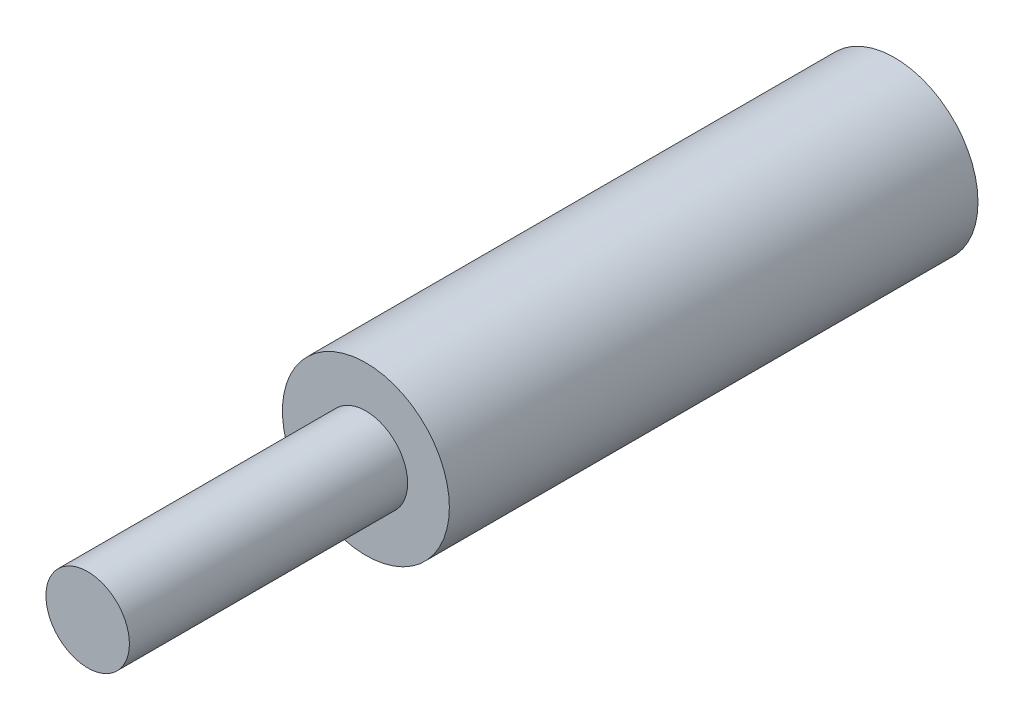
ISO-10303-21;
HEADER;
FILE_DESCRIPTION(('STEP AP214'),'2;1');
FILE_NAME('part.step','',(''),(''),'','','');
FILE_SCHEMA(('AUTOMOTIVE_DESIGN { 1 0 10303 214 1 1 1 1 }'));
ENDSEC;
DATA;
#1=APPLICATION_CONTEXT('core data for automotive mechanical design processes');
#2=APPLICATION_PROTOCOL_DEFINITION('international standard','automotive_design',2000,#1);
#3=PRODUCT_CONTEXT('',#1,'mechanical');
#4=PRODUCT('Part','Part','',(#3));
#5=PRODUCT_RELATED_PRODUCT_CATEGORY('part','',(#4));
#6=PRODUCT_DEFINITION_FORMATION('','',#4);
#7=PRODUCT_DEFINITION_CONTEXT('part definition',#1,'design');
#8=PRODUCT_DEFINITION('design','',#6,#7);
#9=PRODUCT_DEFINITION_SHAPE('','',#8);
#10=(LENGTH_UNIT() NAMED_UNIT(*) SI_UNIT(.MILLI.,.METRE.));
#11=(NAMED_UNIT(*) PLANE_ANGLE_UNIT() SI_UNIT($,.RADIAN.));
#12=(NAMED_UNIT(*) SI_UNIT($,.STERADIAN.) SOLID_ANGLE_UNIT());
#13=UNCERTAINTY_MEASURE_WITH_UNIT(LENGTH_MEASURE(1.E-05),#10,'distance_accuracy_value','');
#14=(GEOMETRIC_REPRESENTATION_CONTEXT(3) GLOBAL_UNCERTAINTY_ASSIGNED_CONTEXT((#13)) GLOBAL_UNIT_ASSIGNED_CONTEXT((#10,
#11,#12)) REPRESENTATION_CONTEXT('',''));
#15=CARTESIAN_POINT('',(0.,0.,0.));
#16=DIRECTION('',(0.,0.,1.));
#17=DIRECTION('',(1.,0.,0.));
#18=AXIS2_PLACEMENT_3D('',#15,#16,#17);
#19=CARTESIAN_POINT('',(0.,0.,19.));
#20=DIRECTION('',(0.,0.,-1.));
#21=DIRECTION('',(-1.,0.,0.));
#22=AXIS2_PLACEMENT_3D('',#19,#20,#21);
#23=CYLINDRICAL_SURFACE('',#22,3.);
#24=CARTESIAN_POINT('',(0.,0.,19.));
#25=DIRECTION('',(0.,0.,1.));
#26=DIRECTION('',(1.,0.,0.));
#27=AXIS2_PLACEMENT_3D('',#24,#25,#26);
#28=CIRCLE('',#27,3.);
#29=CARTESIAN_POINT('',(3.,0.,19.));
#30=VERTEX_POINT('',#29);
#31=EDGE_CURVE('E45',#30,#30,#28,.T.);
#32=ORIENTED_EDGE('',*,*,#31,.F.);
#33=EDGE_LOOP('',(#32));
#34=FACE_BOUND('',#33,.T.);
#35=CARTESIAN_POINT('',(0.,0.,0.));
#36=DIRECTION('',(0.,0.,1.));
#37=DIRECTION('',(1.,0.,0.));
#38=AXIS2_PLACEMENT_3D('',#35,#36,#37);
#39=CIRCLE('',#38,3.);
#40=CARTESIAN_POINT('',(3.,0.,0.));
#41=VERTEX_POINT('',#40);
#42=EDGE_CURVE('E40',#41,#41,#39,.T.);
#43=ORIENTED_EDGE('',*,*,#42,.T.);
#44=EDGE_LOOP('',(#43));
#45=FACE_BOUND('',#44,.T.);
#46=ADVANCED_FACE('F37',(#34,#45),#23,.T.);
#47=CARTESIAN_POINT('',(0.,0.,19.));
#48=DIRECTION('',(0.,0.,1.));
#49=DIRECTION('',(1.,0.,0.));
#50=AXIS2_PLACEMENT_3D('',#47,#48,#49);
#51=PLANE('',#50);
#52=CARTESIAN_POINT('',(0.,0.,19.));
#53=DIRECTION('',(0.,0.,1.));
#54=DIRECTION('',(1.,0.,0.));
#55=AXIS2_PLACEMENT_3D('',#52,#53,#54);
#56=CIRCLE('',#55,1.5);
#57=CARTESIAN_POINT('',(1.5,0.,19.));
#58=VERTEX_POINT('',#57);
#59=EDGE_CURVE('E10',#58,#58,#56,.T.);
#60=ORIENTED_EDGE('',*,*,#59,.F.);
#61=EDGE_LOOP('',(#60));
#62=FACE_BOUND('',#61,.T.);
#63=ORIENTED_EDGE('',*,*,#31,.T.);
#64=EDGE_LOOP('',(#63));
#65=FACE_BOUND('',#64,.T.);
#66=ADVANCED_FACE('F65',(#62,#65),#51,.T.);
#67=CARTESIAN_POINT('',(0.,0.,0.));
#68=DIRECTION('',(0.,0.,1.));
#69=DIRECTION('',(1.,0.,0.));
#70=AXIS2_PLACEMENT_3D('',#67,#68,#69);
#71=PLANE('',#70);
#72=ORIENTED_EDGE('',*,*,#42,.F.);
#73=EDGE_LOOP('',(#72));
#74=FACE_BOUND('',#73,.T.);
#75=ADVANCED_FACE('F62',(#74),#71,.F.);
#76=CARTESIAN_POINT('',(0.,0.,29.));
#77=DIRECTION('',(0.,0.,-1.));
#78=DIRECTION('',(-1.,0.,0.));
#79=AXIS2_PLACEMENT_3D('',#76,#77,#78);
#80=CYLINDRICAL_SURFACE('',#79,1.5);
#81=CARTESIAN_POINT('',(0.,0.,29.));
#82=DIRECTION('',(0.,0.,1.));
#83=DIRECTION('',(1.,0.,0.));
#84=AXIS2_PLACEMENT_3D('',#81,#82,#83);
#85=CIRCLE('',#84,1.5);
#86=CARTESIAN_POINT('',(1.5,0.,29.));
#87=VERTEX_POINT('',#86);
#88=EDGE_CURVE('E52',#87,#87,#85,.T.);
#89=ORIENTED_EDGE('',*,*,#88,.F.);
#90=EDGE_LOOP('',(#89));
#91=FACE_BOUND('',#90,.T.);
#92=ORIENTED_EDGE('',*,*,#59,.T.);
#93=EDGE_LOOP('',(#92));
#94=FACE_BOUND('',#93,.T.);
#95=ADVANCED_FACE('F64',(#91,#94),#80,.T.);
#96=CARTESIAN_POINT('',(0.,0.,29.));
#97=DIRECTION('',(0.,0.,1.));
#98=DIRECTION('',(1.,0.,0.));
#99=AXIS2_PLACEMENT_3D('',#96,#97,#98);
#100=PLANE('',#99);
#101=ORIENTED_EDGE('',*,*,#88,.T.);
#102=EDGE_LOOP('',(#101));
#103=FACE_BOUND('',#102,.T.);
#104=ADVANCED_FACE('F70',(#103),#100,.T.);
#105=CLOSED_SHELL('',(#46,#66,#75,#95,#104));
#106=MANIFOLD_SOLID_BREP('B2',#105);
#107=ADVANCED_BREP_SHAPE_REPRESENTATION('',(#18,#106),#14);
#108=SHAPE_DEFINITION_REPRESENTATION(#9,#107);
ENDSEC;
END-ISO-10303-21;
